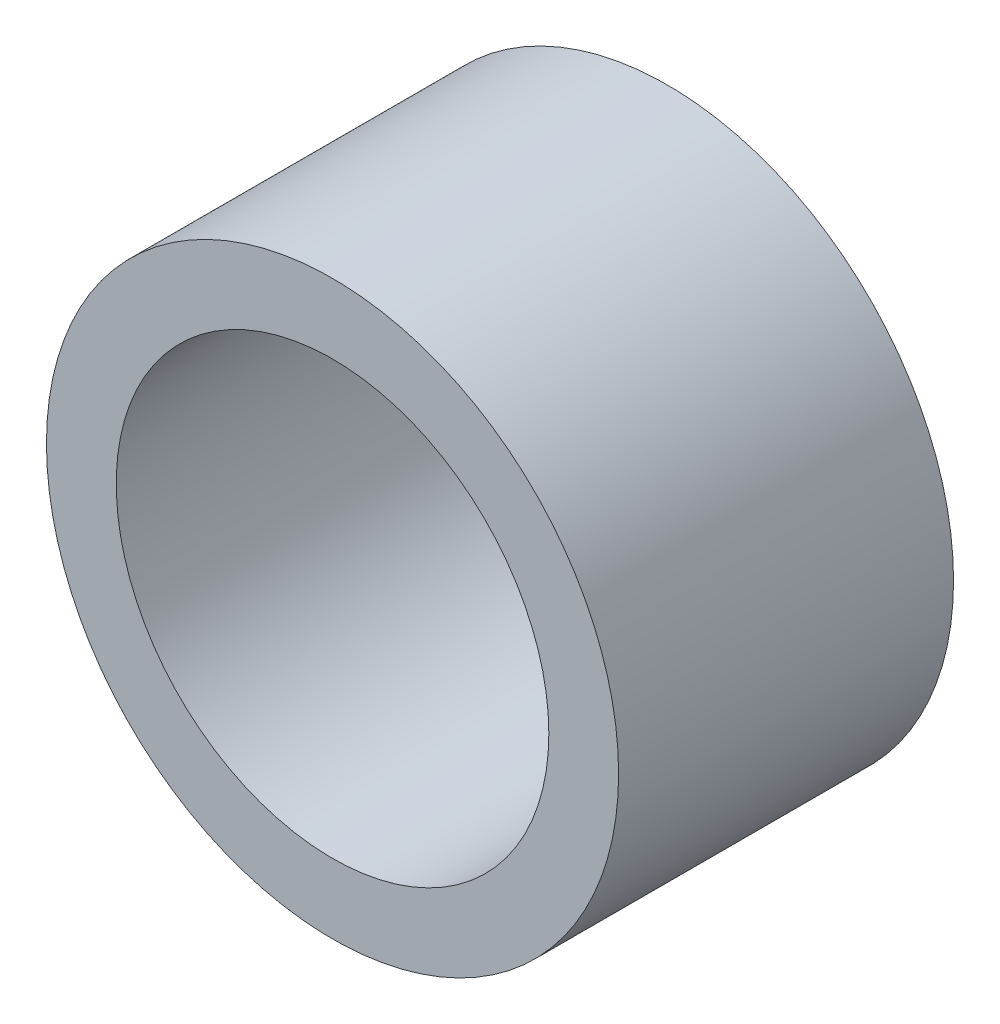
ISO-10303-21;
HEADER;
FILE_DESCRIPTION(('STEP AP214'),'2;1');
FILE_NAME('part.step','',(''),(''),'','','');
FILE_SCHEMA(('AUTOMOTIVE_DESIGN { 1 0 10303 214 1 1 1 1 }'));
ENDSEC;
DATA;
#1=APPLICATION_CONTEXT('core data for automotive mechanical design processes');
#2=APPLICATION_PROTOCOL_DEFINITION('international standard','automotive_design',2000,#1);
#3=PRODUCT_CONTEXT('',#1,'mechanical');
#4=PRODUCT('Part','Part','',(#3));
#5=PRODUCT_RELATED_PRODUCT_CATEGORY('part','',(#4));
#6=PRODUCT_DEFINITION_FORMATION('','',#4);
#7=PRODUCT_DEFINITION_CONTEXT('part definition',#1,'design');
#8=PRODUCT_DEFINITION('design','',#6,#7);
#9=PRODUCT_DEFINITION_SHAPE('','',#8);
#10=(LENGTH_UNIT() NAMED_UNIT(*) SI_UNIT(.MILLI.,.METRE.));
#11=(NAMED_UNIT(*) PLANE_ANGLE_UNIT() SI_UNIT($,.RADIAN.));
#12=(NAMED_UNIT(*) SI_UNIT($,.STERADIAN.) SOLID_ANGLE_UNIT());
#13=UNCERTAINTY_MEASURE_WITH_UNIT(LENGTH_MEASURE(1.E-05),#10,'distance_accuracy_value','');
#14=(GEOMETRIC_REPRESENTATION_CONTEXT(3) GLOBAL_UNCERTAINTY_ASSIGNED_CONTEXT((#13)) GLOBAL_UNIT_ASSIGNED_CONTEXT((#10,
#11,#12)) REPRESENTATION_CONTEXT('',''));
#15=CARTESIAN_POINT('',(0.,0.,0.));
#16=DIRECTION('',(0.,0.,1.));
#17=DIRECTION('',(1.,0.,0.));
#18=AXIS2_PLACEMENT_3D('',#15,#16,#17);
#19=CARTESIAN_POINT('',(0.,0.,6.096));
#20=DIRECTION('',(0.,0.,1.));
#21=DIRECTION('',(1.,0.,0.));
#22=AXIS2_PLACEMENT_3D('',#19,#20,#21);
#23=PLANE('',#22);
#24=CARTESIAN_POINT('',(0.,0.,6.096));
#25=DIRECTION('',(0.,0.,1.));
#26=DIRECTION('',(1.,0.,0.));
#27=AXIS2_PLACEMENT_3D('',#24,#25,#26);
#28=CIRCLE('',#27,5.207);
#29=CARTESIAN_POINT('',(5.207,0.,6.096));
#30=VERTEX_POINT('',#29);
#31=EDGE_CURVE('E10',#30,#30,#28,.T.);
#32=ORIENTED_EDGE('',*,*,#31,.T.);
#33=EDGE_LOOP('',(#32));
#34=FACE_BOUND('',#33,.T.);
#35=CARTESIAN_POINT('',(0.,0.,6.096));
#36=DIRECTION('',(0.,0.,1.));
#37=DIRECTION('',(1.,0.,0.));
#38=AXIS2_PLACEMENT_3D('',#35,#36,#37);
#39=CIRCLE('',#38,3.937);
#40=CARTESIAN_POINT('',(3.937,0.,6.096));
#41=VERTEX_POINT('',#40);
#42=EDGE_CURVE('E42',#41,#41,#39,.T.);
#43=ORIENTED_EDGE('',*,*,#42,.F.);
#44=EDGE_LOOP('',(#43));
#45=FACE_BOUND('',#44,.T.);
#46=ADVANCED_FACE('F31',(#34,#45),#23,.T.);
#47=CARTESIAN_POINT('',(0.,0.,0.));
#48=DIRECTION('',(0.,0.,1.));
#49=DIRECTION('',(1.,0.,0.));
#50=AXIS2_PLACEMENT_3D('',#47,#48,#49);
#51=PLANE('',#50);
#52=CARTESIAN_POINT('',(0.,0.,0.));
#53=DIRECTION('',(0.,0.,1.));
#54=DIRECTION('',(1.,0.,0.));
#55=AXIS2_PLACEMENT_3D('',#52,#53,#54);
#56=CIRCLE('',#55,5.207);
#57=CARTESIAN_POINT('',(5.207,0.,0.));
#58=VERTEX_POINT('',#57);
#59=EDGE_CURVE('E35',#58,#58,#56,.T.);
#60=ORIENTED_EDGE('',*,*,#59,.F.);
#61=EDGE_LOOP('',(#60));
#62=FACE_BOUND('',#61,.T.);
#63=CARTESIAN_POINT('',(0.,0.,0.));
#64=DIRECTION('',(0.,0.,1.));
#65=DIRECTION('',(1.,0.,0.));
#66=AXIS2_PLACEMENT_3D('',#63,#64,#65);
#67=CIRCLE('',#66,3.937);
#68=CARTESIAN_POINT('',(3.937,0.,0.));
#69=VERTEX_POINT('',#68);
#70=EDGE_CURVE('E44',#69,#69,#67,.T.);
#71=ORIENTED_EDGE('',*,*,#70,.T.);
#72=EDGE_LOOP('',(#71));
#73=FACE_BOUND('',#72,.T.);
#74=ADVANCED_FACE('F54',(#62,#73),#51,.F.);
#75=CARTESIAN_POINT('',(0.,0.,6.096));
#76=DIRECTION('',(0.,0.,-1.));
#77=DIRECTION('',(-1.,0.,0.));
#78=AXIS2_PLACEMENT_3D('',#75,#76,#77);
#79=CYLINDRICAL_SURFACE('',#78,5.207);
#80=ORIENTED_EDGE('',*,*,#31,.F.);
#81=EDGE_LOOP('',(#80));
#82=FACE_BOUND('',#81,.T.);
#83=ORIENTED_EDGE('',*,*,#59,.T.);
#84=EDGE_LOOP('',(#83));
#85=FACE_BOUND('',#84,.T.);
#86=ADVANCED_FACE('F33',(#82,#85),#79,.T.);
#87=CARTESIAN_POINT('',(0.,0.,6.096));
#88=DIRECTION('',(0.,0.,-1.));
#89=DIRECTION('',(-1.,0.,0.));
#90=AXIS2_PLACEMENT_3D('',#87,#88,#89);
#91=CYLINDRICAL_SURFACE('',#90,3.937);
#92=ORIENTED_EDGE('',*,*,#42,.T.);
#93=EDGE_LOOP('',(#92));
#94=FACE_BOUND('',#93,.T.);
#95=ORIENTED_EDGE('',*,*,#70,.F.);
#96=EDGE_LOOP('',(#95));
#97=FACE_BOUND('',#96,.T.);
#98=ADVANCED_FACE('F50',(#94,#97),#91,.F.);
#99=CLOSED_SHELL('',(#46,#74,#86,#98));
#100=MANIFOLD_SOLID_BREP('B2',#99);
#101=ADVANCED_BREP_SHAPE_REPRESENTATION('',(#18,#100),#14);
#102=SHAPE_DEFINITION_REPRESENTATION(#9,#101);
ENDSEC;
END-ISO-10303-21;
